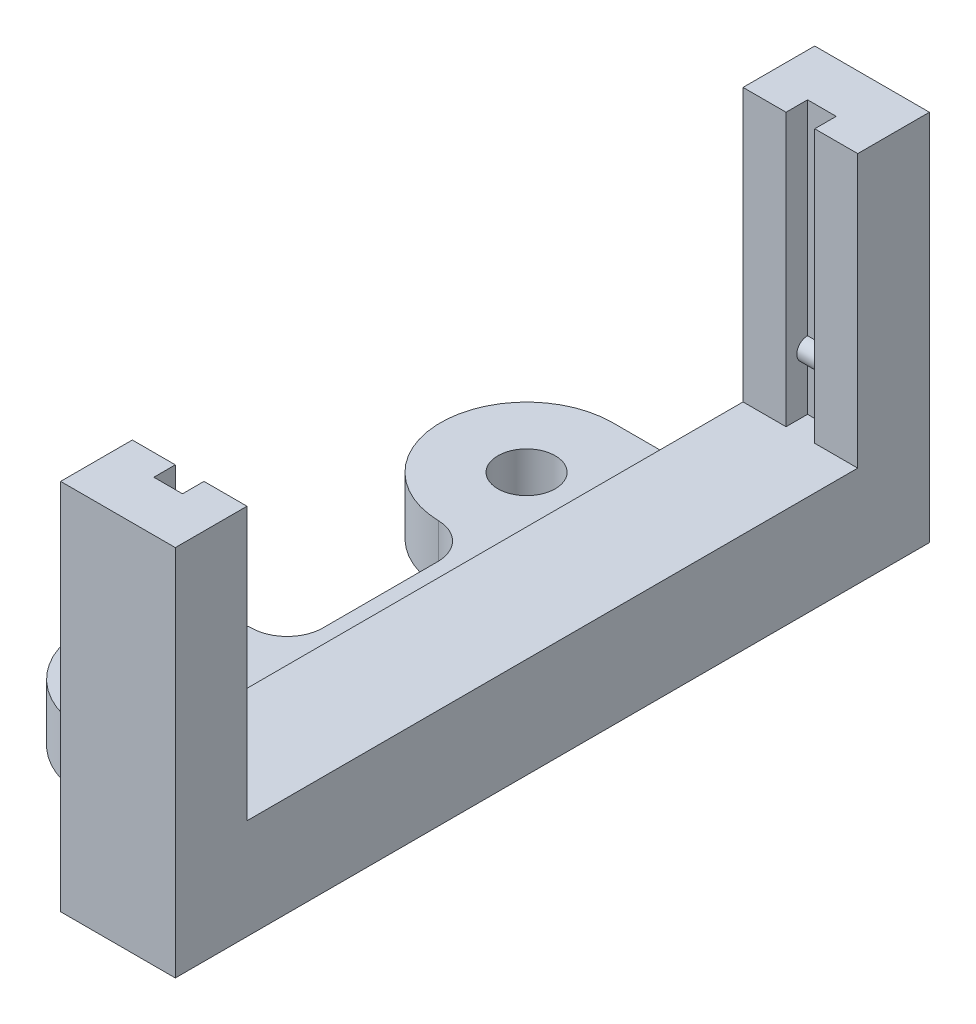
ISO-10303-21;
HEADER;
FILE_DESCRIPTION(('STEP AP214'),'2;1');
FILE_NAME('part.step','',(''),(''),'','','');
FILE_SCHEMA(('AUTOMOTIVE_DESIGN { 1 0 10303 214 1 1 1 1 }'));
ENDSEC;
DATA;
#1=APPLICATION_CONTEXT('core data for automotive mechanical design processes');
#2=APPLICATION_PROTOCOL_DEFINITION('international standard','automotive_design',2000,#1);
#3=PRODUCT_CONTEXT('',#1,'mechanical');
#4=PRODUCT('Part','Part','',(#3));
#5=PRODUCT_RELATED_PRODUCT_CATEGORY('part','',(#4));
#6=PRODUCT_DEFINITION_FORMATION('','',#4);
#7=PRODUCT_DEFINITION_CONTEXT('part definition',#1,'design');
#8=PRODUCT_DEFINITION('design','',#6,#7);
#9=PRODUCT_DEFINITION_SHAPE('','',#8);
#10=(LENGTH_UNIT() NAMED_UNIT(*) SI_UNIT(.MILLI.,.METRE.));
#11=(NAMED_UNIT(*) PLANE_ANGLE_UNIT() SI_UNIT($,.RADIAN.));
#12=(NAMED_UNIT(*) SI_UNIT($,.STERADIAN.) SOLID_ANGLE_UNIT());
#13=UNCERTAINTY_MEASURE_WITH_UNIT(LENGTH_MEASURE(1.E-05),#10,'distance_accuracy_value','');
#14=(GEOMETRIC_REPRESENTATION_CONTEXT(3) GLOBAL_UNCERTAINTY_ASSIGNED_CONTEXT((#13)) GLOBAL_UNIT_ASSIGNED_CONTEXT((#10,
#11,#12)) REPRESENTATION_CONTEXT('',''));
#15=CARTESIAN_POINT('',(0.,0.,0.));
#16=DIRECTION('',(0.,0.,1.));
#17=DIRECTION('',(1.,0.,0.));
#18=AXIS2_PLACEMENT_3D('',#15,#16,#17);
#19=CARTESIAN_POINT('',(0.,26.,22.8));
#20=DIRECTION('',(0.,0.,-1.));
#21=DIRECTION('',(-1.,0.,0.));
#22=AXIS2_PLACEMENT_3D('',#19,#20,#21);
#23=PLANE('',#22);
#24=DIRECTION('',(-1.,0.,0.));
#25=VECTOR('',#24,1.);
#26=CARTESIAN_POINT('',(35.6250357198611,10.25,22.8));
#27=LINE('',#26,#25);
#28=CARTESIAN_POINT('',(33.9479847367362,10.25,22.8));
#29=VERTEX_POINT('',#28);
#30=CARTESIAN_POINT('',(31.9479847367362,10.25,22.8));
#31=VERTEX_POINT('',#30);
#32=EDGE_CURVE('E245',#29,#31,#27,.T.);
#33=ORIENTED_EDGE('',*,*,#32,.F.);
#34=DIRECTION('',(0.,-1.,0.));
#35=VECTOR('',#34,1.);
#36=CARTESIAN_POINT('',(33.9479847367362,26.,22.8));
#37=LINE('',#36,#35);
#38=CARTESIAN_POINT('',(33.9479847367362,7.,22.8));
#39=VERTEX_POINT('',#38);
#40=EDGE_CURVE('E229',#29,#39,#37,.T.);
#41=ORIENTED_EDGE('',*,*,#40,.T.);
#42=DIRECTION('',(-1.,0.,0.));
#43=VECTOR('',#42,1.);
#44=CARTESIAN_POINT('',(0.,7.,22.8));
#45=LINE('',#44,#43);
#46=CARTESIAN_POINT('',(31.9479847367362,7.,22.8));
#47=VERTEX_POINT('',#46);
#48=EDGE_CURVE('E434',#39,#47,#45,.T.);
#49=ORIENTED_EDGE('',*,*,#48,.T.);
#50=DIRECTION('',(0.,-1.,0.));
#51=VECTOR('',#50,1.);
#52=CARTESIAN_POINT('',(31.9479847367362,26.,22.8));
#53=LINE('',#52,#51);
#54=EDGE_CURVE('E246',#31,#47,#53,.T.);
#55=ORIENTED_EDGE('',*,*,#54,.F.);
#56=EDGE_LOOP('',(#33,#41,#49,#55));
#57=FACE_BOUND('',#56,.T.);
#58=ADVANCED_FACE('F34',(#57),#23,.T.);
#59=CARTESIAN_POINT('',(31.9479847367362,26.,0.));
#60=DIRECTION('',(1.,0.,0.));
#61=DIRECTION('',(0.,0.,-1.));
#62=AXIS2_PLACEMENT_3D('',#59,#60,#61);
#63=PLANE('',#62);
#64=DIRECTION('',(0.,-1.,0.));
#65=VECTOR('',#64,1.);
#66=CARTESIAN_POINT('',(31.9479847367362,26.,-22.8));
#67=LINE('',#66,#65);
#68=CARTESIAN_POINT('',(31.9479847367362,10.25,-22.8));
#69=VERTEX_POINT('',#68);
#70=CARTESIAN_POINT('',(31.9479847367362,7.,-22.8));
#71=VERTEX_POINT('',#70);
#72=EDGE_CURVE('E333',#69,#71,#67,.T.);
#73=ORIENTED_EDGE('',*,*,#72,.F.);
#74=CARTESIAN_POINT('',(31.9479847367362,11.,-22.8));
#75=DIRECTION('',(1.,0.,0.));
#76=DIRECTION('',(0.,0.,-1.));
#77=AXIS2_PLACEMENT_3D('',#74,#75,#76);
#78=CIRCLE('',#77,0.75);
#79=CARTESIAN_POINT('',(31.9479847367362,11.75,-22.8));
#80=VERTEX_POINT('',#79);
#81=EDGE_CURVE('E254',#80,#69,#78,.T.);
#82=ORIENTED_EDGE('',*,*,#81,.F.);
#83=CARTESIAN_POINT('',(31.9479847367362,26.,-22.8));
#84=VERTEX_POINT('',#83);
#85=EDGE_CURVE('E334',#84,#80,#67,.T.);
#86=ORIENTED_EDGE('',*,*,#85,.F.);
#87=DIRECTION('',(0.,0.,1.));
#88=VECTOR('',#87,1.);
#89=CARTESIAN_POINT('',(31.9479847367362,26.,0.));
#90=LINE('',#89,#88);
#91=CARTESIAN_POINT('',(31.9479847367362,26.,-21.3));
#92=VERTEX_POINT('',#91);
#93=EDGE_CURVE('E313',#84,#92,#90,.T.);
#94=ORIENTED_EDGE('',*,*,#93,.T.);
#95=DIRECTION('',(0.,-1.,0.));
#96=VECTOR('',#95,1.);
#97=CARTESIAN_POINT('',(31.9479847367362,26.,-21.3));
#98=LINE('',#97,#96);
#99=CARTESIAN_POINT('',(31.9479847367362,7.,-21.3));
#100=VERTEX_POINT('',#99);
#101=EDGE_CURVE('E337',#92,#100,#98,.T.);
#102=ORIENTED_EDGE('',*,*,#101,.T.);
#103=DIRECTION('',(0.,0.,-1.));
#104=VECTOR('',#103,1.);
#105=CARTESIAN_POINT('',(31.9479847367362,7.,0.));
#106=LINE('',#105,#104);
#107=EDGE_CURVE('E425',#100,#71,#106,.T.);
#108=ORIENTED_EDGE('',*,*,#107,.T.);
#109=EDGE_LOOP('',(#73,#82,#86,#94,#102,#108));
#110=FACE_BOUND('',#109,.T.);
#111=ADVANCED_FACE('F544',(#110),#63,.T.);
#112=CARTESIAN_POINT('',(0.,26.,-22.8));
#113=DIRECTION('',(0.,0.,-1.));
#114=DIRECTION('',(-1.,0.,0.));
#115=AXIS2_PLACEMENT_3D('',#112,#113,#114);
#116=PLANE('',#115);
#117=DIRECTION('',(-1.,0.,0.));
#118=VECTOR('',#117,1.);
#119=CARTESIAN_POINT('',(35.6250357198611,10.25,-22.8));
#120=LINE('',#119,#118);
#121=CARTESIAN_POINT('',(33.9479847367362,10.25,-22.8));
#122=VERTEX_POINT('',#121);
#123=EDGE_CURVE('E257',#122,#69,#120,.T.);
#124=ORIENTED_EDGE('',*,*,#123,.T.);
#125=ORIENTED_EDGE('',*,*,#72,.T.);
#126=DIRECTION('',(-1.,0.,0.));
#127=VECTOR('',#126,1.);
#128=CARTESIAN_POINT('',(0.,7.,-22.8));
#129=LINE('',#128,#127);
#130=CARTESIAN_POINT('',(33.9479847367362,7.,-22.8));
#131=VERTEX_POINT('',#130);
#132=EDGE_CURVE('E422',#131,#71,#129,.T.);
#133=ORIENTED_EDGE('',*,*,#132,.F.);
#134=DIRECTION('',(0.,-1.,0.));
#135=VECTOR('',#134,1.);
#136=CARTESIAN_POINT('',(33.9479847367362,26.,-22.8));
#137=LINE('',#136,#135);
#138=EDGE_CURVE('E330',#122,#131,#137,.T.);
#139=ORIENTED_EDGE('',*,*,#138,.F.);
#140=EDGE_LOOP('',(#124,#125,#133,#139));
#141=FACE_BOUND('',#140,.T.);
#142=ADVANCED_FACE('F578',(#141),#116,.F.);
#143=DIRECTION('',(-1.,0.,0.));
#144=VECTOR('',#143,1.);
#145=CARTESIAN_POINT('',(35.6250357198611,11.75,-22.8));
#146=LINE('',#145,#144);
#147=CARTESIAN_POINT('',(33.9479847367362,11.75,-22.8));
#148=VERTEX_POINT('',#147);
#149=EDGE_CURVE('E263',#148,#80,#146,.T.);
#150=ORIENTED_EDGE('',*,*,#149,.F.);
#151=CARTESIAN_POINT('',(33.9479847367362,26.,-22.8));
#152=VERTEX_POINT('',#151);
#153=EDGE_CURVE('E331',#152,#148,#137,.T.);
#154=ORIENTED_EDGE('',*,*,#153,.F.);
#155=DIRECTION('',(1.,0.,0.));
#156=VECTOR('',#155,1.);
#157=CARTESIAN_POINT('',(0.,26.,-22.8));
#158=LINE('',#157,#156);
#159=EDGE_CURVE('E316',#84,#152,#158,.T.);
#160=ORIENTED_EDGE('',*,*,#159,.F.);
#161=ORIENTED_EDGE('',*,*,#85,.T.);
#162=EDGE_LOOP('',(#150,#154,#160,#161));
#163=FACE_BOUND('',#162,.T.);
#164=ADVANCED_FACE('F583',(#163),#116,.F.);
#165=CARTESIAN_POINT('',(33.9479847367362,26.,0.));
#166=DIRECTION('',(1.,0.,0.));
#167=DIRECTION('',(0.,0.,-1.));
#168=AXIS2_PLACEMENT_3D('',#165,#166,#167);
#169=PLANE('',#168);
#170=CARTESIAN_POINT('',(33.9479847367362,11.,-22.8));
#171=DIRECTION('',(-1.,0.,0.));
#172=DIRECTION('',(0.,0.,1.));
#173=AXIS2_PLACEMENT_3D('',#170,#171,#172);
#174=CIRCLE('',#173,0.75);
#175=EDGE_CURVE('E266',#122,#148,#174,.T.);
#176=ORIENTED_EDGE('',*,*,#175,.F.);
#177=ORIENTED_EDGE('',*,*,#138,.T.);
#178=DIRECTION('',(0.,0.,-1.));
#179=VECTOR('',#178,1.);
#180=CARTESIAN_POINT('',(33.9479847367362,7.,0.));
#181=LINE('',#180,#179);
#182=CARTESIAN_POINT('',(33.9479847367362,7.,-21.3));
#183=VERTEX_POINT('',#182);
#184=EDGE_CURVE('E419',#183,#131,#181,.T.);
#185=ORIENTED_EDGE('',*,*,#184,.F.);
#186=DIRECTION('',(0.,-1.,0.));
#187=VECTOR('',#186,1.);
#188=CARTESIAN_POINT('',(33.9479847367362,26.,-21.3));
#189=LINE('',#188,#187);
#190=CARTESIAN_POINT('',(33.9479847367362,26.,-21.3));
#191=VERTEX_POINT('',#190);
#192=EDGE_CURVE('E327',#191,#183,#189,.T.);
#193=ORIENTED_EDGE('',*,*,#192,.F.);
#194=DIRECTION('',(0.,0.,1.));
#195=VECTOR('',#194,1.);
#196=CARTESIAN_POINT('',(33.9479847367362,26.,0.));
#197=LINE('',#196,#195);
#198=EDGE_CURVE('E318',#152,#191,#197,.T.);
#199=ORIENTED_EDGE('',*,*,#198,.F.);
#200=ORIENTED_EDGE('',*,*,#153,.T.);
#201=EDGE_LOOP('',(#176,#177,#185,#193,#199,#200));
#202=FACE_BOUND('',#201,.T.);
#203=ADVANCED_FACE('F573',(#202),#169,.F.);
#204=CARTESIAN_POINT('',(0.,7.,0.));
#205=DIRECTION('',(0.,1.,0.));
#206=DIRECTION('',(0.,0.,1.));
#207=AXIS2_PLACEMENT_3D('',#204,#205,#206);
#208=PLANE('',#207);
#209=DIRECTION('',(0.,0.,1.));
#210=VECTOR('',#209,1.);
#211=CARTESIAN_POINT('',(28.9479847367362,7.,0.));
#212=LINE('',#211,#210);
#213=CARTESIAN_POINT('',(28.9479847367362,7.,-21.3));
#214=VERTEX_POINT('',#213);
#215=CARTESIAN_POINT('',(28.9479847367362,7.,21.3));
#216=VERTEX_POINT('',#215);
#217=EDGE_CURVE('E346',#214,#216,#212,.T.);
#218=ORIENTED_EDGE('',*,*,#217,.T.);
#219=DIRECTION('',(1.,0.,0.));
#220=VECTOR('',#219,1.);
#221=CARTESIAN_POINT('',(0.,7.,21.3));
#222=LINE('',#221,#220);
#223=CARTESIAN_POINT('',(31.9479847367362,7.,21.3));
#224=VERTEX_POINT('',#223);
#225=EDGE_CURVE('E439',#216,#224,#222,.T.);
#226=ORIENTED_EDGE('',*,*,#225,.T.);
#227=DIRECTION('',(0.,0.,1.));
#228=VECTOR('',#227,1.);
#229=CARTESIAN_POINT('',(31.9479847367362,7.,0.));
#230=LINE('',#229,#228);
#231=EDGE_CURVE('E436',#224,#47,#230,.T.);
#232=ORIENTED_EDGE('',*,*,#231,.T.);
#233=ORIENTED_EDGE('',*,*,#48,.F.);
#234=DIRECTION('',(0.,0.,1.));
#235=VECTOR('',#234,1.);
#236=CARTESIAN_POINT('',(33.9479847367362,7.,0.));
#237=LINE('',#236,#235);
#238=CARTESIAN_POINT('',(33.9479847367362,7.,21.3));
#239=VERTEX_POINT('',#238);
#240=EDGE_CURVE('E236',#239,#39,#237,.T.);
#241=ORIENTED_EDGE('',*,*,#240,.F.);
#242=DIRECTION('',(-1.,0.,0.));
#243=VECTOR('',#242,1.);
#244=CARTESIAN_POINT('',(0.,7.,21.3));
#245=LINE('',#244,#243);
#246=CARTESIAN_POINT('',(36.9479847367362,7.,21.3));
#247=VERTEX_POINT('',#246);
#248=EDGE_CURVE('E431',#247,#239,#245,.T.);
#249=ORIENTED_EDGE('',*,*,#248,.F.);
#250=DIRECTION('',(0.,0.,1.));
#251=VECTOR('',#250,1.);
#252=CARTESIAN_POINT('',(36.9479847367362,7.,0.));
#253=LINE('',#252,#251);
#254=CARTESIAN_POINT('',(36.9479847367362,7.,-21.3));
#255=VERTEX_POINT('',#254);
#256=EDGE_CURVE('E343',#255,#247,#253,.T.);
#257=ORIENTED_EDGE('',*,*,#256,.F.);
#258=DIRECTION('',(-1.,0.,0.));
#259=VECTOR('',#258,1.);
#260=CARTESIAN_POINT('',(0.,7.,-21.3));
#261=LINE('',#260,#259);
#262=EDGE_CURVE('E416',#255,#183,#261,.T.);
#263=ORIENTED_EDGE('',*,*,#262,.T.);
#264=ORIENTED_EDGE('',*,*,#184,.T.);
#265=ORIENTED_EDGE('',*,*,#132,.T.);
#266=ORIENTED_EDGE('',*,*,#107,.F.);
#267=DIRECTION('',(1.,0.,0.));
#268=VECTOR('',#267,1.);
#269=CARTESIAN_POINT('',(0.,7.,-21.3));
#270=LINE('',#269,#268);
#271=EDGE_CURVE('E428',#214,#100,#270,.T.);
#272=ORIENTED_EDGE('',*,*,#271,.F.);
#273=EDGE_LOOP('',(#218,#226,#232,#233,#241,#249,#257,#263,#264,#265,#266,#272));
#274=FACE_BOUND('',#273,.T.);
#275=ADVANCED_FACE('F536',(#274),#208,.T.);
#276=CARTESIAN_POINT('',(0.,4.,-18.5));
#277=DIRECTION('',(0.,0.,-1.));
#278=DIRECTION('',(-1.,0.,0.));
#279=AXIS2_PLACEMENT_3D('',#276,#277,#278);
#280=PLANE('',#279);
#281=DIRECTION('',(1.,0.,0.));
#282=VECTOR('',#281,1.);
#283=CARTESIAN_POINT('',(0.,4.,-18.5));
#284=LINE('',#283,#282);
#285=CARTESIAN_POINT('',(22.6479847367362,4.,-18.5));
#286=VERTEX_POINT('',#285);
#287=CARTESIAN_POINT('',(26.4479847367362,4.,-18.5));
#288=VERTEX_POINT('',#287);
#289=EDGE_CURVE('E370',#286,#288,#284,.T.);
#290=ORIENTED_EDGE('',*,*,#289,.T.);
#291=DIRECTION('',(0.,-1.,0.));
#292=VECTOR('',#291,1.);
#293=CARTESIAN_POINT('',(26.4479847367362,4.,-18.5));
#294=LINE('',#293,#292);
#295=CARTESIAN_POINT('',(26.4479847367362,0.,-18.5));
#296=VERTEX_POINT('',#295);
#297=EDGE_CURVE('E459',#288,#296,#294,.T.);
#298=ORIENTED_EDGE('',*,*,#297,.T.);
#299=DIRECTION('',(1.,0.,0.));
#300=VECTOR('',#299,1.);
#301=CARTESIAN_POINT('',(0.,0.,-18.5));
#302=LINE('',#301,#300);
#303=CARTESIAN_POINT('',(22.6479847367362,0.,-18.5));
#304=VERTEX_POINT('',#303);
#305=EDGE_CURVE('E369',#304,#296,#302,.T.);
#306=ORIENTED_EDGE('',*,*,#305,.F.);
#307=DIRECTION('',(0.,-1.,0.));
#308=VECTOR('',#307,1.);
#309=CARTESIAN_POINT('',(22.6479847367362,4.,-18.5));
#310=LINE('',#309,#308);
#311=EDGE_CURVE('E414',#286,#304,#310,.T.);
#312=ORIENTED_EDGE('',*,*,#311,.F.);
#313=EDGE_LOOP('',(#290,#298,#306,#312));
#314=FACE_BOUND('',#313,.T.);
#315=ADVANCED_FACE('F483',(#314),#280,.T.);
#316=CARTESIAN_POINT('',(22.6479847367362,4.,-12.5));
#317=DIRECTION('',(0.,-1.,0.));
#318=DIRECTION('',(0.,0.,-1.));
#319=AXIS2_PLACEMENT_3D('',#316,#317,#318);
#320=CYLINDRICAL_SURFACE('',#319,6.);
#321=CARTESIAN_POINT('',(22.6479847367362,0.,-12.5));
#322=DIRECTION('',(0.,1.,0.));
#323=DIRECTION('',(0.,0.,1.));
#324=AXIS2_PLACEMENT_3D('',#321,#322,#323);
#325=CIRCLE('',#324,6.);
#326=CARTESIAN_POINT('',(22.506808266148,0.,-6.50166112959994));
#327=VERTEX_POINT('',#326);
#328=EDGE_CURVE('E396',#304,#327,#325,.T.);
#329=ORIENTED_EDGE('',*,*,#328,.T.);
#330=DIRECTION('',(0.,-1.,0.));
#331=VECTOR('',#330,1.);
#332=CARTESIAN_POINT('',(22.506808266148,4.,-6.50166112959994));
#333=LINE('',#332,#331);
#334=CARTESIAN_POINT('',(22.506808266148,4.,-6.50166112959994));
#335=VERTEX_POINT('',#334);
#336=EDGE_CURVE('E457',#327,#335,#333,.F.);
#337=ORIENTED_EDGE('',*,*,#336,.T.);
#338=CARTESIAN_POINT('',(22.6479847367362,4.,-12.5));
#339=DIRECTION('',(0.,1.,0.));
#340=DIRECTION('',(0.,0.,1.));
#341=AXIS2_PLACEMENT_3D('',#338,#339,#340);
#342=CIRCLE('',#341,6.);
#343=EDGE_CURVE('E372',#286,#335,#342,.T.);
#344=ORIENTED_EDGE('',*,*,#343,.F.);
#345=ORIENTED_EDGE('',*,*,#311,.T.);
#346=EDGE_LOOP('',(#329,#337,#344,#345));
#347=FACE_BOUND('',#346,.T.);
#348=ADVANCED_FACE('F644',(#347),#320,.T.);
#349=CARTESIAN_POINT('',(24.9479847367362,4.,0.));
#350=DIRECTION('',(1.,0.,0.));
#351=DIRECTION('',(0.,0.,-1.));
#352=AXIS2_PLACEMENT_3D('',#349,#350,#351);
#353=PLANE('',#352);
#354=DIRECTION('',(0.,0.,1.));
#355=VECTOR('',#354,1.);
#356=CARTESIAN_POINT('',(24.9479847367362,0.,0.));
#357=LINE('',#356,#355);
#358=CARTESIAN_POINT('',(24.9479847367362,0.,-4.00235326693325));
#359=VERTEX_POINT('',#358);
#360=CARTESIAN_POINT('',(24.9479847367362,0.,4.00235326693325));
#361=VERTEX_POINT('',#360);
#362=EDGE_CURVE('E399',#359,#361,#357,.T.);
#363=ORIENTED_EDGE('',*,*,#362,.T.);
#364=DIRECTION('',(0.,-1.,0.));
#365=VECTOR('',#364,1.);
#366=CARTESIAN_POINT('',(24.9479847367362,4.,4.00235326693325));
#367=LINE('',#366,#365);
#368=CARTESIAN_POINT('',(24.9479847367362,4.,4.00235326693325));
#369=VERTEX_POINT('',#368);
#370=EDGE_CURVE('E455',#361,#369,#367,.F.);
#371=ORIENTED_EDGE('',*,*,#370,.T.);
#372=DIRECTION('',(0.,0.,1.));
#373=VECTOR('',#372,1.);
#374=CARTESIAN_POINT('',(24.9479847367362,4.,0.));
#375=LINE('',#374,#373);
#376=CARTESIAN_POINT('',(24.9479847367362,4.,-4.00235326693325));
#377=VERTEX_POINT('',#376);
#378=EDGE_CURVE('E376',#377,#369,#375,.T.);
#379=ORIENTED_EDGE('',*,*,#378,.F.);
#380=DIRECTION('',(0.,1.,0.));
#381=VECTOR('',#380,1.);
#382=CARTESIAN_POINT('',(24.9479847367362,0.,-4.00235326693325));
#383=LINE('',#382,#381);
#384=EDGE_CURVE('E452',#377,#359,#383,.F.);
#385=ORIENTED_EDGE('',*,*,#384,.T.);
#386=EDGE_LOOP('',(#363,#371,#379,#385));
#387=FACE_BOUND('',#386,.T.);
#388=ADVANCED_FACE('F496',(#387),#353,.F.);
#389=CARTESIAN_POINT('',(22.6479847367362,4.,12.5));
#390=DIRECTION('',(0.,-1.,0.));
#391=DIRECTION('',(0.,0.,-1.));
#392=AXIS2_PLACEMENT_3D('',#389,#390,#391);
#393=CYLINDRICAL_SURFACE('',#392,6.);
#394=CARTESIAN_POINT('',(22.6479847367362,4.,12.5));
#395=DIRECTION('',(0.,1.,0.));
#396=DIRECTION('',(0.,0.,1.));
#397=AXIS2_PLACEMENT_3D('',#394,#395,#396);
#398=CIRCLE('',#397,6.);
#399=CARTESIAN_POINT('',(22.6479847367362,4.,18.5));
#400=VERTEX_POINT('',#399);
#401=CARTESIAN_POINT('',(22.506808266148,4.,6.50166112959994));
#402=VERTEX_POINT('',#401);
#403=EDGE_CURVE('E379',#400,#402,#398,.F.);
#404=ORIENTED_EDGE('',*,*,#403,.T.);
#405=DIRECTION('',(0.,-1.,0.));
#406=VECTOR('',#405,1.);
#407=CARTESIAN_POINT('',(22.506808266148,4.,6.50166112959994));
#408=LINE('',#407,#406);
#409=CARTESIAN_POINT('',(22.506808266148,0.,6.50166112959994));
#410=VERTEX_POINT('',#409);
#411=EDGE_CURVE('E449',#402,#410,#408,.T.);
#412=ORIENTED_EDGE('',*,*,#411,.T.);
#413=CARTESIAN_POINT('',(22.6479847367362,0.,12.5));
#414=DIRECTION('',(0.,1.,0.));
#415=DIRECTION('',(0.,0.,1.));
#416=AXIS2_PLACEMENT_3D('',#413,#414,#415);
#417=CIRCLE('',#416,6.);
#418=CARTESIAN_POINT('',(22.6479847367362,0.,18.5));
#419=VERTEX_POINT('',#418);
#420=EDGE_CURVE('E402',#419,#410,#417,.F.);
#421=ORIENTED_EDGE('',*,*,#420,.F.);
#422=DIRECTION('',(0.,-1.,0.));
#423=VECTOR('',#422,1.);
#424=CARTESIAN_POINT('',(22.6479847367362,4.,18.5));
#425=LINE('',#424,#423);
#426=EDGE_CURVE('E393',#400,#419,#425,.T.);
#427=ORIENTED_EDGE('',*,*,#426,.F.);
#428=EDGE_LOOP('',(#404,#412,#421,#427));
#429=FACE_BOUND('',#428,.T.);
#430=ADVANCED_FACE('F505',(#429),#393,.T.);
#431=CARTESIAN_POINT('',(0.,4.,18.5));
#432=DIRECTION('',(0.,0.,-1.));
#433=DIRECTION('',(-1.,0.,0.));
#434=AXIS2_PLACEMENT_3D('',#431,#432,#433);
#435=PLANE('',#434);
#436=DIRECTION('',(1.,0.,0.));
#437=VECTOR('',#436,1.);
#438=CARTESIAN_POINT('',(0.,0.,18.5));
#439=LINE('',#438,#437);
#440=CARTESIAN_POINT('',(26.4479847367362,0.,18.5));
#441=VERTEX_POINT('',#440);
#442=EDGE_CURVE('E405',#419,#441,#439,.T.);
#443=ORIENTED_EDGE('',*,*,#442,.T.);
#444=DIRECTION('',(0.,-1.,0.));
#445=VECTOR('',#444,1.);
#446=CARTESIAN_POINT('',(26.4479847367362,4.,18.5));
#447=LINE('',#446,#445);
#448=CARTESIAN_POINT('',(26.4479847367362,4.,18.5));
#449=VERTEX_POINT('',#448);
#450=EDGE_CURVE('E447',#441,#449,#447,.F.);
#451=ORIENTED_EDGE('',*,*,#450,.T.);
#452=DIRECTION('',(1.,0.,0.));
#453=VECTOR('',#452,1.);
#454=CARTESIAN_POINT('',(0.,4.,18.5));
#455=LINE('',#454,#453);
#456=EDGE_CURVE('E382',#400,#449,#455,.T.);
#457=ORIENTED_EDGE('',*,*,#456,.F.);
#458=ORIENTED_EDGE('',*,*,#426,.T.);
#459=EDGE_LOOP('',(#443,#451,#457,#458));
#460=FACE_BOUND('',#459,.T.);
#461=ADVANCED_FACE('F636',(#460),#435,.F.);
#462=CARTESIAN_POINT('',(22.6479847367362,4.,-12.5));
#463=DIRECTION('',(0.,-1.,0.));
#464=DIRECTION('',(0.,0.,-1.));
#465=AXIS2_PLACEMENT_3D('',#462,#463,#464);
#466=CYLINDRICAL_SURFACE('',#465,2.);
#467=CARTESIAN_POINT('',(22.6479847367362,4.,-12.5));
#468=DIRECTION('',(0.,1.,0.));
#469=DIRECTION('',(0.,0.,1.));
#470=AXIS2_PLACEMENT_3D('',#467,#468,#469);
#471=CIRCLE('',#470,2.);
#472=CARTESIAN_POINT('',(22.6479847367362,4.,-10.5));
#473=VERTEX_POINT('',#472);
#474=EDGE_CURVE('E387',#473,#473,#471,.T.);
#475=ORIENTED_EDGE('',*,*,#474,.T.);
#476=EDGE_LOOP('',(#475));
#477=FACE_BOUND('',#476,.T.);
#478=CARTESIAN_POINT('',(22.6479847367362,0.,-12.5));
#479=DIRECTION('',(0.,1.,0.));
#480=DIRECTION('',(0.,0.,1.));
#481=AXIS2_PLACEMENT_3D('',#478,#479,#480);
#482=CIRCLE('',#481,2.);
#483=CARTESIAN_POINT('',(22.6479847367362,0.,-10.5));
#484=VERTEX_POINT('',#483);
#485=EDGE_CURVE('E408',#484,#484,#482,.T.);
#486=ORIENTED_EDGE('',*,*,#485,.F.);
#487=EDGE_LOOP('',(#486));
#488=FACE_BOUND('',#487,.T.);
#489=ADVANCED_FACE('F632',(#477,#488),#466,.F.);
#490=CARTESIAN_POINT('',(22.6479847367362,4.,12.5));
#491=DIRECTION('',(0.,-1.,0.));
#492=DIRECTION('',(0.,0.,-1.));
#493=AXIS2_PLACEMENT_3D('',#490,#491,#492);
#494=CYLINDRICAL_SURFACE('',#493,2.);
#495=CARTESIAN_POINT('',(22.6479847367362,4.,12.5));
#496=DIRECTION('',(0.,1.,0.));
#497=DIRECTION('',(0.,0.,1.));
#498=AXIS2_PLACEMENT_3D('',#495,#496,#497);
#499=CIRCLE('',#498,2.);
#500=CARTESIAN_POINT('',(22.6479847367362,4.,14.5));
#501=VERTEX_POINT('',#500);
#502=EDGE_CURVE('E390',#501,#501,#499,.F.);
#503=ORIENTED_EDGE('',*,*,#502,.F.);
#504=EDGE_LOOP('',(#503));
#505=FACE_BOUND('',#504,.T.);
#506=CARTESIAN_POINT('',(22.6479847367362,0.,12.5));
#507=DIRECTION('',(0.,1.,0.));
#508=DIRECTION('',(0.,0.,1.));
#509=AXIS2_PLACEMENT_3D('',#506,#507,#508);
#510=CIRCLE('',#509,2.);
#511=CARTESIAN_POINT('',(22.6479847367362,0.,14.5));
#512=VERTEX_POINT('',#511);
#513=EDGE_CURVE('E373',#512,#512,#510,.F.);
#514=ORIENTED_EDGE('',*,*,#513,.T.);
#515=EDGE_LOOP('',(#514));
#516=FACE_BOUND('',#515,.T.);
#517=ADVANCED_FACE('F627',(#505,#516),#494,.F.);
#518=CARTESIAN_POINT('',(0.,4.,0.));
#519=DIRECTION('',(0.,1.,0.));
#520=DIRECTION('',(0.,0.,1.));
#521=AXIS2_PLACEMENT_3D('',#518,#519,#520);
#522=PLANE('',#521);
#523=ORIENTED_EDGE('',*,*,#289,.F.);
#524=ORIENTED_EDGE('',*,*,#343,.T.);
#525=CARTESIAN_POINT('',(22.4479847367362,4.,-4.00235326693325));
#526=DIRECTION('',(0.,1.,0.));
#527=DIRECTION('',(0.,0.,1.));
#528=AXIS2_PLACEMENT_3D('',#525,#526,#527);
#529=CIRCLE('',#528,2.5);
#530=EDGE_CURVE('E472',#335,#377,#529,.F.);
#531=ORIENTED_EDGE('',*,*,#530,.T.);
#532=ORIENTED_EDGE('',*,*,#378,.T.);
#533=CARTESIAN_POINT('',(22.4479847367362,4.,4.00235326693325));
#534=DIRECTION('',(0.,1.,0.));
#535=DIRECTION('',(0.,0.,1.));
#536=AXIS2_PLACEMENT_3D('',#533,#534,#535);
#537=CIRCLE('',#536,2.5);
#538=EDGE_CURVE('E468',#369,#402,#537,.F.);
#539=ORIENTED_EDGE('',*,*,#538,.T.);
#540=ORIENTED_EDGE('',*,*,#403,.F.);
#541=ORIENTED_EDGE('',*,*,#456,.T.);
#542=CARTESIAN_POINT('',(26.4479847367362,4.,21.));
#543=DIRECTION('',(0.,1.,0.));
#544=DIRECTION('',(0.,0.,1.));
#545=AXIS2_PLACEMENT_3D('',#542,#543,#544);
#546=CIRCLE('',#545,2.5);
#547=CARTESIAN_POINT('',(28.9479847367362,4.,21.));
#548=VERTEX_POINT('',#547);
#549=EDGE_CURVE('E463',#449,#548,#546,.F.);
#550=ORIENTED_EDGE('',*,*,#549,.T.);
#551=DIRECTION('',(0.,0.,1.));
#552=VECTOR('',#551,1.);
#553=CARTESIAN_POINT('',(28.9479847367362,4.,0.));
#554=LINE('',#553,#552);
#555=CARTESIAN_POINT('',(28.9479847367362,4.,-21.));
#556=VERTEX_POINT('',#555);
#557=EDGE_CURVE('E385',#556,#548,#554,.T.);
#558=ORIENTED_EDGE('',*,*,#557,.F.);
#559=CARTESIAN_POINT('',(26.4479847367362,4.,-21.));
#560=DIRECTION('',(0.,1.,0.));
#561=DIRECTION('',(0.,0.,1.));
#562=AXIS2_PLACEMENT_3D('',#559,#560,#561);
#563=CIRCLE('',#562,2.5);
#564=EDGE_CURVE('E11',#556,#288,#563,.F.);
#565=ORIENTED_EDGE('',*,*,#564,.T.);
#566=EDGE_LOOP('',(#523,#524,#531,#532,#539,#540,#541,#550,#558,#565));
#567=FACE_BOUND('',#566,.T.);
#568=ORIENTED_EDGE('',*,*,#474,.F.);
#569=EDGE_LOOP('',(#568));
#570=FACE_BOUND('',#569,.T.);
#571=ORIENTED_EDGE('',*,*,#502,.T.);
#572=EDGE_LOOP('',(#571));
#573=FACE_BOUND('',#572,.T.);
#574=ADVANCED_FACE('F485',(#567,#570,#573),#522,.T.);
#575=CARTESIAN_POINT('',(0.,0.,0.));
#576=DIRECTION('',(0.,1.,0.));
#577=DIRECTION('',(0.,0.,1.));
#578=AXIS2_PLACEMENT_3D('',#575,#576,#577);
#579=PLANE('',#578);
#580=ORIENTED_EDGE('',*,*,#305,.T.);
#581=CARTESIAN_POINT('',(26.4479847367362,0.,-21.));
#582=DIRECTION('',(0.,1.,0.));
#583=DIRECTION('',(0.,0.,1.));
#584=AXIS2_PLACEMENT_3D('',#581,#582,#583);
#585=CIRCLE('',#584,2.5);
#586=CARTESIAN_POINT('',(28.9479847367362,0.,-21.));
#587=VERTEX_POINT('',#586);
#588=EDGE_CURVE('E42',#296,#587,#585,.T.);
#589=ORIENTED_EDGE('',*,*,#588,.T.);
#590=DIRECTION('',(0.,0.,1.));
#591=VECTOR('',#590,1.);
#592=CARTESIAN_POINT('',(28.9479847367362,0.,0.));
#593=LINE('',#592,#591);
#594=CARTESIAN_POINT('',(28.9479847367362,0.,-26.3));
#595=VERTEX_POINT('',#594);
#596=EDGE_CURVE('E356',#595,#587,#593,.T.);
#597=ORIENTED_EDGE('',*,*,#596,.F.);
#598=DIRECTION('',(1.,0.,0.));
#599=VECTOR('',#598,1.);
#600=CARTESIAN_POINT('',(0.,0.,-26.3));
#601=LINE('',#600,#599);
#602=CARTESIAN_POINT('',(36.9479847367362,0.,-26.3));
#603=VERTEX_POINT('',#602);
#604=EDGE_CURVE('E352',#595,#603,#601,.T.);
#605=ORIENTED_EDGE('',*,*,#604,.T.);
#606=DIRECTION('',(0.,0.,1.));
#607=VECTOR('',#606,1.);
#608=CARTESIAN_POINT('',(36.9479847367362,0.,0.));
#609=LINE('',#608,#607);
#610=CARTESIAN_POINT('',(36.9479847367362,0.,26.3));
#611=VERTEX_POINT('',#610);
#612=EDGE_CURVE('E342',#603,#611,#609,.T.);
#613=ORIENTED_EDGE('',*,*,#612,.T.);
#614=DIRECTION('',(1.,0.,0.));
#615=VECTOR('',#614,1.);
#616=CARTESIAN_POINT('',(0.,0.,26.3));
#617=LINE('',#616,#615);
#618=CARTESIAN_POINT('',(28.9479847367362,0.,26.3));
#619=VERTEX_POINT('',#618);
#620=EDGE_CURVE('E347',#619,#611,#617,.T.);
#621=ORIENTED_EDGE('',*,*,#620,.F.);
#622=CARTESIAN_POINT('',(28.9479847367362,0.,21.));
#623=VERTEX_POINT('',#622);
#624=EDGE_CURVE('E355',#623,#619,#593,.T.);
#625=ORIENTED_EDGE('',*,*,#624,.F.);
#626=CARTESIAN_POINT('',(26.4479847367362,0.,21.));
#627=DIRECTION('',(0.,1.,0.));
#628=DIRECTION('',(0.,0.,1.));
#629=AXIS2_PLACEMENT_3D('',#626,#627,#628);
#630=CIRCLE('',#629,2.5);
#631=EDGE_CURVE('E461',#623,#441,#630,.T.);
#632=ORIENTED_EDGE('',*,*,#631,.T.);
#633=ORIENTED_EDGE('',*,*,#442,.F.);
#634=ORIENTED_EDGE('',*,*,#420,.T.);
#635=CARTESIAN_POINT('',(22.4479847367362,0.,4.00235326693325));
#636=DIRECTION('',(0.,1.,0.));
#637=DIRECTION('',(0.,0.,1.));
#638=AXIS2_PLACEMENT_3D('',#635,#636,#637);
#639=CIRCLE('',#638,2.5);
#640=EDGE_CURVE('E466',#410,#361,#639,.T.);
#641=ORIENTED_EDGE('',*,*,#640,.T.);
#642=ORIENTED_EDGE('',*,*,#362,.F.);
#643=CARTESIAN_POINT('',(22.4479847367362,0.,-4.00235326693325));
#644=DIRECTION('',(0.,1.,0.));
#645=DIRECTION('',(0.,0.,1.));
#646=AXIS2_PLACEMENT_3D('',#643,#644,#645);
#647=CIRCLE('',#646,2.5);
#648=EDGE_CURVE('E470',#359,#327,#647,.T.);
#649=ORIENTED_EDGE('',*,*,#648,.T.);
#650=ORIENTED_EDGE('',*,*,#328,.F.);
#651=EDGE_LOOP('',(#580,#589,#597,#605,#613,#621,#625,#632,#633,#634,#641,#642,#649,#650));
#652=FACE_BOUND('',#651,.T.);
#653=ORIENTED_EDGE('',*,*,#485,.T.);
#654=EDGE_LOOP('',(#653));
#655=FACE_BOUND('',#654,.T.);
#656=ORIENTED_EDGE('',*,*,#513,.F.);
#657=EDGE_LOOP('',(#656));
#658=FACE_BOUND('',#657,.T.);
#659=ADVANCED_FACE('F475',(#652,#655,#658),#579,.F.);
#660=CARTESIAN_POINT('',(36.9479847367362,7.,0.));
#661=DIRECTION('',(1.,0.,0.));
#662=DIRECTION('',(0.,0.,-1.));
#663=AXIS2_PLACEMENT_3D('',#660,#661,#662);
#664=PLANE('',#663);
#665=ORIENTED_EDGE('',*,*,#256,.T.);
#666=DIRECTION('',(0.,-1.,0.));
#667=VECTOR('',#666,1.);
#668=CARTESIAN_POINT('',(36.9479847367362,26.,21.3));
#669=LINE('',#668,#667);
#670=CARTESIAN_POINT('',(36.9479847367362,26.,21.3));
#671=VERTEX_POINT('',#670);
#672=EDGE_CURVE('E292',#671,#247,#669,.T.);
#673=ORIENTED_EDGE('',*,*,#672,.F.);
#674=DIRECTION('',(0.,0.,1.));
#675=VECTOR('',#674,1.);
#676=CARTESIAN_POINT('',(36.9479847367362,26.,0.));
#677=LINE('',#676,#675);
#678=CARTESIAN_POINT('',(36.9479847367362,26.,26.3));
#679=VERTEX_POINT('',#678);
#680=EDGE_CURVE('E282',#671,#679,#677,.T.);
#681=ORIENTED_EDGE('',*,*,#680,.T.);
#682=DIRECTION('',(0.,-1.,0.));
#683=VECTOR('',#682,1.);
#684=CARTESIAN_POINT('',(36.9479847367362,7.,26.3));
#685=LINE('',#684,#683);
#686=EDGE_CURVE('E349',#679,#611,#685,.T.);
#687=ORIENTED_EDGE('',*,*,#686,.T.);
#688=ORIENTED_EDGE('',*,*,#612,.F.);
#689=DIRECTION('',(0.,-1.,0.));
#690=VECTOR('',#689,1.);
#691=CARTESIAN_POINT('',(36.9479847367362,7.,-26.3));
#692=LINE('',#691,#690);
#693=CARTESIAN_POINT('',(36.9479847367362,26.,-26.3));
#694=VERTEX_POINT('',#693);
#695=EDGE_CURVE('E367',#694,#603,#692,.T.);
#696=ORIENTED_EDGE('',*,*,#695,.F.);
#697=DIRECTION('',(0.,0.,-1.));
#698=VECTOR('',#697,1.);
#699=CARTESIAN_POINT('',(36.9479847367362,26.,0.));
#700=LINE('',#699,#698);
#701=CARTESIAN_POINT('',(36.9479847367362,26.,-21.3));
#702=VERTEX_POINT('',#701);
#703=EDGE_CURVE('E322',#702,#694,#700,.T.);
#704=ORIENTED_EDGE('',*,*,#703,.F.);
#705=DIRECTION('',(0.,-1.,0.));
#706=VECTOR('',#705,1.);
#707=CARTESIAN_POINT('',(36.9479847367362,26.,-21.3));
#708=LINE('',#707,#706);
#709=EDGE_CURVE('E325',#702,#255,#708,.T.);
#710=ORIENTED_EDGE('',*,*,#709,.T.);
#711=EDGE_LOOP('',(#665,#673,#681,#687,#688,#696,#704,#710));
#712=FACE_BOUND('',#711,.T.);
#713=ADVANCED_FACE('F555',(#712),#664,.T.);
#714=CARTESIAN_POINT('',(0.,7.,-26.3));
#715=DIRECTION('',(0.,0.,-1.));
#716=DIRECTION('',(-1.,0.,0.));
#717=AXIS2_PLACEMENT_3D('',#714,#715,#716);
#718=PLANE('',#717);
#719=ORIENTED_EDGE('',*,*,#695,.T.);
#720=ORIENTED_EDGE('',*,*,#604,.F.);
#721=DIRECTION('',(0.,-1.,0.));
#722=VECTOR('',#721,1.);
#723=CARTESIAN_POINT('',(28.9479847367362,7.,-26.3));
#724=LINE('',#723,#722);
#725=CARTESIAN_POINT('',(28.9479847367362,26.,-26.3));
#726=VERTEX_POINT('',#725);
#727=EDGE_CURVE('E365',#726,#595,#724,.T.);
#728=ORIENTED_EDGE('',*,*,#727,.F.);
#729=DIRECTION('',(1.,0.,0.));
#730=VECTOR('',#729,1.);
#731=CARTESIAN_POINT('',(0.,26.,-26.3));
#732=LINE('',#731,#730);
#733=EDGE_CURVE('E304',#726,#694,#732,.T.);
#734=ORIENTED_EDGE('',*,*,#733,.T.);
#735=EDGE_LOOP('',(#719,#720,#728,#734));
#736=FACE_BOUND('',#735,.T.);
#737=ADVANCED_FACE('F553',(#736),#718,.T.);
#738=CARTESIAN_POINT('',(28.9479847367362,7.,0.));
#739=DIRECTION('',(1.,0.,0.));
#740=DIRECTION('',(0.,0.,-1.));
#741=AXIS2_PLACEMENT_3D('',#738,#739,#740);
#742=PLANE('',#741);
#743=ORIENTED_EDGE('',*,*,#557,.T.);
#744=DIRECTION('',(0.,-1.,0.));
#745=VECTOR('',#744,1.);
#746=CARTESIAN_POINT('',(28.9479847367362,0.,21.));
#747=LINE('',#746,#745);
#748=EDGE_CURVE('E444',#548,#623,#747,.T.);
#749=ORIENTED_EDGE('',*,*,#748,.T.);
#750=ORIENTED_EDGE('',*,*,#624,.T.);
#751=DIRECTION('',(0.,-1.,0.));
#752=VECTOR('',#751,1.);
#753=CARTESIAN_POINT('',(28.9479847367362,7.,26.3));
#754=LINE('',#753,#752);
#755=CARTESIAN_POINT('',(28.9479847367362,26.,26.3));
#756=VERTEX_POINT('',#755);
#757=EDGE_CURVE('E362',#756,#619,#754,.T.);
#758=ORIENTED_EDGE('',*,*,#757,.F.);
#759=DIRECTION('',(0.,0.,1.));
#760=VECTOR('',#759,1.);
#761=CARTESIAN_POINT('',(28.9479847367363,26.,0.));
#762=LINE('',#761,#760);
#763=CARTESIAN_POINT('',(28.9479847367362,26.,21.3));
#764=VERTEX_POINT('',#763);
#765=EDGE_CURVE('E276',#764,#756,#762,.T.);
#766=ORIENTED_EDGE('',*,*,#765,.F.);
#767=DIRECTION('',(0.,-1.,0.));
#768=VECTOR('',#767,1.);
#769=CARTESIAN_POINT('',(28.9479847367362,26.,21.3));
#770=LINE('',#769,#768);
#771=EDGE_CURVE('E295',#764,#216,#770,.T.);
#772=ORIENTED_EDGE('',*,*,#771,.T.);
#773=ORIENTED_EDGE('',*,*,#217,.F.);
#774=DIRECTION('',(0.,-1.,0.));
#775=VECTOR('',#774,1.);
#776=CARTESIAN_POINT('',(28.9479847367362,26.,-21.3));
#777=LINE('',#776,#775);
#778=CARTESIAN_POINT('',(28.9479847367362,26.,-21.3));
#779=VERTEX_POINT('',#778);
#780=EDGE_CURVE('E340',#779,#214,#777,.T.);
#781=ORIENTED_EDGE('',*,*,#780,.F.);
#782=DIRECTION('',(0.,0.,-1.));
#783=VECTOR('',#782,1.);
#784=CARTESIAN_POINT('',(28.9479847367363,26.,0.));
#785=LINE('',#784,#783);
#786=EDGE_CURVE('E307',#779,#726,#785,.T.);
#787=ORIENTED_EDGE('',*,*,#786,.T.);
#788=ORIENTED_EDGE('',*,*,#727,.T.);
#789=ORIENTED_EDGE('',*,*,#596,.T.);
#790=DIRECTION('',(0.,-1.,0.));
#791=VECTOR('',#790,1.);
#792=CARTESIAN_POINT('',(28.9479847367362,7.,-21.));
#793=LINE('',#792,#791);
#794=EDGE_CURVE('E441',#587,#556,#793,.F.);
#795=ORIENTED_EDGE('',*,*,#794,.T.);
#796=EDGE_LOOP('',(#743,#749,#750,#758,#766,#772,#773,#781,#787,#788,#789,#795));
#797=FACE_BOUND('',#796,.T.);
#798=ADVANCED_FACE('F481',(#797),#742,.F.);
#799=CARTESIAN_POINT('',(0.,7.,26.3));
#800=DIRECTION('',(0.,0.,-1.));
#801=DIRECTION('',(-1.,0.,0.));
#802=AXIS2_PLACEMENT_3D('',#799,#800,#801);
#803=PLANE('',#802);
#804=ORIENTED_EDGE('',*,*,#757,.T.);
#805=ORIENTED_EDGE('',*,*,#620,.T.);
#806=ORIENTED_EDGE('',*,*,#686,.F.);
#807=DIRECTION('',(1.,0.,0.));
#808=VECTOR('',#807,1.);
#809=CARTESIAN_POINT('',(0.,26.,26.3));
#810=LINE('',#809,#808);
#811=EDGE_CURVE('E279',#756,#679,#810,.T.);
#812=ORIENTED_EDGE('',*,*,#811,.F.);
#813=EDGE_LOOP('',(#804,#805,#806,#812));
#814=FACE_BOUND('',#813,.T.);
#815=ADVANCED_FACE('F518',(#814),#803,.F.);
#816=CARTESIAN_POINT('',(0.,26.,-21.3));
#817=DIRECTION('',(0.,0.,1.));
#818=DIRECTION('',(1.,0.,0.));
#819=AXIS2_PLACEMENT_3D('',#816,#817,#818);
#820=PLANE('',#819);
#821=ORIENTED_EDGE('',*,*,#780,.T.);
#822=ORIENTED_EDGE('',*,*,#271,.T.);
#823=ORIENTED_EDGE('',*,*,#101,.F.);
#824=DIRECTION('',(-1.,0.,0.));
#825=VECTOR('',#824,1.);
#826=CARTESIAN_POINT('',(0.,26.,-21.3));
#827=LINE('',#826,#825);
#828=EDGE_CURVE('E310',#92,#779,#827,.T.);
#829=ORIENTED_EDGE('',*,*,#828,.T.);
#830=EDGE_LOOP('',(#821,#822,#823,#829));
#831=FACE_BOUND('',#830,.T.);
#832=ADVANCED_FACE('F540',(#831),#820,.T.);
#833=CARTESIAN_POINT('',(0.,26.,-21.3));
#834=DIRECTION('',(0.,0.,-1.));
#835=DIRECTION('',(-1.,0.,0.));
#836=AXIS2_PLACEMENT_3D('',#833,#834,#835);
#837=PLANE('',#836);
#838=ORIENTED_EDGE('',*,*,#262,.F.);
#839=ORIENTED_EDGE('',*,*,#709,.F.);
#840=DIRECTION('',(1.,0.,0.));
#841=VECTOR('',#840,1.);
#842=CARTESIAN_POINT('',(0.,26.,-21.3));
#843=LINE('',#842,#841);
#844=EDGE_CURVE('E320',#191,#702,#843,.T.);
#845=ORIENTED_EDGE('',*,*,#844,.F.);
#846=ORIENTED_EDGE('',*,*,#192,.T.);
#847=EDGE_LOOP('',(#838,#839,#845,#846));
#848=FACE_BOUND('',#847,.T.);
#849=ADVANCED_FACE('F569',(#848),#837,.F.);
#850=CARTESIAN_POINT('',(0.,26.,0.));
#851=DIRECTION('',(0.,1.,0.));
#852=DIRECTION('',(0.,0.,1.));
#853=AXIS2_PLACEMENT_3D('',#850,#851,#852);
#854=PLANE('',#853);
#855=ORIENTED_EDGE('',*,*,#733,.F.);
#856=ORIENTED_EDGE('',*,*,#786,.F.);
#857=ORIENTED_EDGE('',*,*,#828,.F.);
#858=ORIENTED_EDGE('',*,*,#93,.F.);
#859=ORIENTED_EDGE('',*,*,#159,.T.);
#860=ORIENTED_EDGE('',*,*,#198,.T.);
#861=ORIENTED_EDGE('',*,*,#844,.T.);
#862=ORIENTED_EDGE('',*,*,#703,.T.);
#863=EDGE_LOOP('',(#855,#856,#857,#858,#859,#860,#861,#862));
#864=FACE_BOUND('',#863,.T.);
#865=ADVANCED_FACE('F549',(#864),#854,.T.);
#866=DIRECTION('',(-1.,0.,0.));
#867=VECTOR('',#866,1.);
#868=CARTESIAN_POINT('',(35.6250357198611,11.75,22.8));
#869=LINE('',#868,#867);
#870=CARTESIAN_POINT('',(33.9479847367362,11.75,22.8));
#871=VERTEX_POINT('',#870);
#872=CARTESIAN_POINT('',(31.9479847367362,11.75,22.8));
#873=VERTEX_POINT('',#872);
#874=EDGE_CURVE('E249',#871,#873,#869,.T.);
#875=ORIENTED_EDGE('',*,*,#874,.T.);
#876=CARTESIAN_POINT('',(31.9479847367362,26.,22.8));
#877=VERTEX_POINT('',#876);
#878=EDGE_CURVE('E301',#877,#873,#53,.T.);
#879=ORIENTED_EDGE('',*,*,#878,.F.);
#880=DIRECTION('',(1.,0.,0.));
#881=VECTOR('',#880,1.);
#882=CARTESIAN_POINT('',(0.,26.,22.8));
#883=LINE('',#882,#881);
#884=CARTESIAN_POINT('',(33.9479847367362,26.,22.8));
#885=VERTEX_POINT('',#884);
#886=EDGE_CURVE('E269',#877,#885,#883,.T.);
#887=ORIENTED_EDGE('',*,*,#886,.T.);
#888=EDGE_CURVE('E240',#885,#871,#37,.T.);
#889=ORIENTED_EDGE('',*,*,#888,.T.);
#890=EDGE_LOOP('',(#875,#879,#887,#889));
#891=FACE_BOUND('',#890,.T.);
#892=ADVANCED_FACE('F561',(#891),#23,.T.);
#893=CARTESIAN_POINT('',(31.9479847367362,26.,0.));
#894=DIRECTION('',(-1.,0.,0.));
#895=DIRECTION('',(0.,0.,1.));
#896=AXIS2_PLACEMENT_3D('',#893,#894,#895);
#897=PLANE('',#896);
#898=ORIENTED_EDGE('',*,*,#878,.T.);
#899=CARTESIAN_POINT('',(31.9479847367362,11.,22.8));
#900=DIRECTION('',(1.,0.,0.));
#901=DIRECTION('',(0.,0.,-1.));
#902=AXIS2_PLACEMENT_3D('',#899,#900,#901);
#903=CIRCLE('',#902,0.75);
#904=EDGE_CURVE('E250',#873,#31,#903,.F.);
#905=ORIENTED_EDGE('',*,*,#904,.T.);
#906=ORIENTED_EDGE('',*,*,#54,.T.);
#907=ORIENTED_EDGE('',*,*,#231,.F.);
#908=DIRECTION('',(0.,-1.,0.));
#909=VECTOR('',#908,1.);
#910=CARTESIAN_POINT('',(31.9479847367362,26.,21.3));
#911=LINE('',#910,#909);
#912=CARTESIAN_POINT('',(31.9479847367362,26.,21.3));
#913=VERTEX_POINT('',#912);
#914=EDGE_CURVE('E298',#913,#224,#911,.T.);
#915=ORIENTED_EDGE('',*,*,#914,.F.);
#916=DIRECTION('',(0.,0.,-1.));
#917=VECTOR('',#916,1.);
#918=CARTESIAN_POINT('',(31.9479847367362,26.,0.));
#919=LINE('',#918,#917);
#920=EDGE_CURVE('E272',#877,#913,#919,.T.);
#921=ORIENTED_EDGE('',*,*,#920,.F.);
#922=EDGE_LOOP('',(#898,#905,#906,#907,#915,#921));
#923=FACE_BOUND('',#922,.T.);
#924=ADVANCED_FACE('F563',(#923),#897,.F.);
#925=CARTESIAN_POINT('',(0.,26.,21.3));
#926=DIRECTION('',(0.,0.,1.));
#927=DIRECTION('',(1.,0.,0.));
#928=AXIS2_PLACEMENT_3D('',#925,#926,#927);
#929=PLANE('',#928);
#930=ORIENTED_EDGE('',*,*,#225,.F.);
#931=ORIENTED_EDGE('',*,*,#771,.F.);
#932=DIRECTION('',(-1.,0.,0.));
#933=VECTOR('',#932,1.);
#934=CARTESIAN_POINT('',(0.,26.,21.3));
#935=LINE('',#934,#933);
#936=EDGE_CURVE('E274',#913,#764,#935,.T.);
#937=ORIENTED_EDGE('',*,*,#936,.F.);
#938=ORIENTED_EDGE('',*,*,#914,.T.);
#939=EDGE_LOOP('',(#930,#931,#937,#938));
#940=FACE_BOUND('',#939,.T.);
#941=ADVANCED_FACE('F531',(#940),#929,.F.);
#942=CARTESIAN_POINT('',(0.,26.,21.3));
#943=DIRECTION('',(0.,0.,-1.));
#944=DIRECTION('',(-1.,0.,0.));
#945=AXIS2_PLACEMENT_3D('',#942,#943,#944);
#946=PLANE('',#945);
#947=ORIENTED_EDGE('',*,*,#672,.T.);
#948=ORIENTED_EDGE('',*,*,#248,.T.);
#949=DIRECTION('',(0.,-1.,0.));
#950=VECTOR('',#949,1.);
#951=CARTESIAN_POINT('',(33.9479847367362,26.,21.3));
#952=LINE('',#951,#950);
#953=CARTESIAN_POINT('',(33.9479847367362,26.,21.3));
#954=VERTEX_POINT('',#953);
#955=EDGE_CURVE('E290',#954,#239,#952,.T.);
#956=ORIENTED_EDGE('',*,*,#955,.F.);
#957=DIRECTION('',(1.,0.,0.));
#958=VECTOR('',#957,1.);
#959=CARTESIAN_POINT('',(0.,26.,21.3));
#960=LINE('',#959,#958);
#961=EDGE_CURVE('E285',#954,#671,#960,.T.);
#962=ORIENTED_EDGE('',*,*,#961,.T.);
#963=EDGE_LOOP('',(#947,#948,#956,#962));
#964=FACE_BOUND('',#963,.T.);
#965=ADVANCED_FACE('F559',(#964),#946,.T.);
#966=CARTESIAN_POINT('',(33.9479847367362,26.,0.));
#967=DIRECTION('',(-1.,0.,0.));
#968=DIRECTION('',(0.,0.,1.));
#969=AXIS2_PLACEMENT_3D('',#966,#967,#968);
#970=PLANE('',#969);
#971=CARTESIAN_POINT('',(33.9479847367362,11.,22.8));
#972=DIRECTION('',(-1.,0.,0.));
#973=DIRECTION('',(0.,0.,1.));
#974=AXIS2_PLACEMENT_3D('',#971,#972,#973);
#975=CIRCLE('',#974,0.75);
#976=EDGE_CURVE('E233',#29,#871,#975,.F.);
#977=ORIENTED_EDGE('',*,*,#976,.T.);
#978=ORIENTED_EDGE('',*,*,#888,.F.);
#979=DIRECTION('',(0.,0.,-1.));
#980=VECTOR('',#979,1.);
#981=CARTESIAN_POINT('',(33.9479847367362,26.,0.));
#982=LINE('',#981,#980);
#983=EDGE_CURVE('E241',#885,#954,#982,.T.);
#984=ORIENTED_EDGE('',*,*,#983,.T.);
#985=ORIENTED_EDGE('',*,*,#955,.T.);
#986=ORIENTED_EDGE('',*,*,#240,.T.);
#987=ORIENTED_EDGE('',*,*,#40,.F.);
#988=EDGE_LOOP('',(#977,#978,#984,#985,#986,#987));
#989=FACE_BOUND('',#988,.T.);
#990=ADVANCED_FACE('F231',(#989),#970,.T.);
#991=CARTESIAN_POINT('',(0.,26.,0.));
#992=DIRECTION('',(0.,1.,0.));
#993=DIRECTION('',(0.,0.,1.));
#994=AXIS2_PLACEMENT_3D('',#991,#992,#993);
#995=PLANE('',#994);
#996=ORIENTED_EDGE('',*,*,#886,.F.);
#997=ORIENTED_EDGE('',*,*,#920,.T.);
#998=ORIENTED_EDGE('',*,*,#936,.T.);
#999=ORIENTED_EDGE('',*,*,#765,.T.);
#1000=ORIENTED_EDGE('',*,*,#811,.T.);
#1001=ORIENTED_EDGE('',*,*,#680,.F.);
#1002=ORIENTED_EDGE('',*,*,#961,.F.);
#1003=ORIENTED_EDGE('',*,*,#983,.F.);
#1004=EDGE_LOOP('',(#996,#997,#998,#999,#1000,#1001,#1002,#1003));
#1005=FACE_BOUND('',#1004,.T.);
#1006=ADVANCED_FACE('F523',(#1005),#995,.T.);
#1007=CARTESIAN_POINT('',(35.6250357198611,11.,-22.8));
#1008=DIRECTION('',(-1.,0.,0.));
#1009=DIRECTION('',(0.,0.,1.));
#1010=AXIS2_PLACEMENT_3D('',#1007,#1008,#1009);
#1011=CYLINDRICAL_SURFACE('',#1010,0.75);
#1012=ORIENTED_EDGE('',*,*,#123,.F.);
#1013=ORIENTED_EDGE('',*,*,#175,.T.);
#1014=ORIENTED_EDGE('',*,*,#149,.T.);
#1015=ORIENTED_EDGE('',*,*,#81,.T.);
#1016=EDGE_LOOP('',(#1012,#1013,#1014,#1015));
#1017=FACE_BOUND('',#1016,.T.);
#1018=ADVANCED_FACE('F580',(#1017),#1011,.T.);
#1019=CARTESIAN_POINT('',(35.6250357198611,11.,22.8));
#1020=DIRECTION('',(-1.,0.,0.));
#1021=DIRECTION('',(0.,0.,1.));
#1022=AXIS2_PLACEMENT_3D('',#1019,#1020,#1021);
#1023=CYLINDRICAL_SURFACE('',#1022,0.75);
#1024=ORIENTED_EDGE('',*,*,#976,.F.);
#1025=ORIENTED_EDGE('',*,*,#32,.T.);
#1026=ORIENTED_EDGE('',*,*,#904,.F.);
#1027=ORIENTED_EDGE('',*,*,#874,.F.);
#1028=EDGE_LOOP('',(#1024,#1025,#1026,#1027));
#1029=FACE_BOUND('',#1028,.T.);
#1030=ADVANCED_FACE('F253',(#1029),#1023,.T.);
#1031=CARTESIAN_POINT('',(26.4479847367362,7.,21.));
#1032=DIRECTION('',(0.,1.,0.));
#1033=DIRECTION('',(0.,0.,1.));
#1034=AXIS2_PLACEMENT_3D('',#1031,#1032,#1033);
#1035=CYLINDRICAL_SURFACE('',#1034,2.5);
#1036=ORIENTED_EDGE('',*,*,#549,.F.);
#1037=ORIENTED_EDGE('',*,*,#450,.F.);
#1038=ORIENTED_EDGE('',*,*,#631,.F.);
#1039=ORIENTED_EDGE('',*,*,#748,.F.);
#1040=EDGE_LOOP('',(#1036,#1037,#1038,#1039));
#1041=FACE_BOUND('',#1040,.T.);
#1042=ADVANCED_FACE('F513',(#1041),#1035,.F.);
#1043=CARTESIAN_POINT('',(22.4479847367362,4.,4.00235326693325));
#1044=DIRECTION('',(0.,-1.,0.));
#1045=DIRECTION('',(0.,0.,-1.));
#1046=AXIS2_PLACEMENT_3D('',#1043,#1044,#1045);
#1047=CYLINDRICAL_SURFACE('',#1046,2.5);
#1048=ORIENTED_EDGE('',*,*,#538,.F.);
#1049=ORIENTED_EDGE('',*,*,#370,.F.);
#1050=ORIENTED_EDGE('',*,*,#640,.F.);
#1051=ORIENTED_EDGE('',*,*,#411,.F.);
#1052=EDGE_LOOP('',(#1048,#1049,#1050,#1051));
#1053=FACE_BOUND('',#1052,.T.);
#1054=ADVANCED_FACE('F503',(#1053),#1047,.F.);
#1055=CARTESIAN_POINT('',(22.4479847367362,4.,-4.00235326693325));
#1056=DIRECTION('',(0.,-1.,0.));
#1057=DIRECTION('',(0.,0.,-1.));
#1058=AXIS2_PLACEMENT_3D('',#1055,#1056,#1057);
#1059=CYLINDRICAL_SURFACE('',#1058,2.5);
#1060=ORIENTED_EDGE('',*,*,#530,.F.);
#1061=ORIENTED_EDGE('',*,*,#336,.F.);
#1062=ORIENTED_EDGE('',*,*,#648,.F.);
#1063=ORIENTED_EDGE('',*,*,#384,.F.);
#1064=EDGE_LOOP('',(#1060,#1061,#1062,#1063));
#1065=FACE_BOUND('',#1064,.T.);
#1066=ADVANCED_FACE('F493',(#1065),#1059,.F.);
#1067=CARTESIAN_POINT('',(26.4479847367362,4.,-21.));
#1068=DIRECTION('',(0.,-1.,0.));
#1069=DIRECTION('',(0.,0.,-1.));
#1070=AXIS2_PLACEMENT_3D('',#1067,#1068,#1069);
#1071=CYLINDRICAL_SURFACE('',#1070,2.5);
#1072=ORIENTED_EDGE('',*,*,#564,.F.);
#1073=ORIENTED_EDGE('',*,*,#794,.F.);
#1074=ORIENTED_EDGE('',*,*,#588,.F.);
#1075=ORIENTED_EDGE('',*,*,#297,.F.);
#1076=EDGE_LOOP('',(#1072,#1073,#1074,#1075));
#1077=FACE_BOUND('',#1076,.T.);
#1078=ADVANCED_FACE('F36',(#1077),#1071,.F.);
#1079=CLOSED_SHELL('',(#58,#111,#142,#164,#203,#275,#315,#348,#388,#430,#461,#489,#517,#574,
#659,#713,#737,#798,#815,#832,#849,#865,#892,#924,#941,#965,#990,#1006,#1018,#1030,#1042,#1054,
#1066,#1078));
#1080=MANIFOLD_SOLID_BREP('B2',#1079);
#1081=ADVANCED_BREP_SHAPE_REPRESENTATION('',(#18,#1080),#14);
#1082=SHAPE_DEFINITION_REPRESENTATION(#9,#1081);
ENDSEC;
END-ISO-10303-21;
